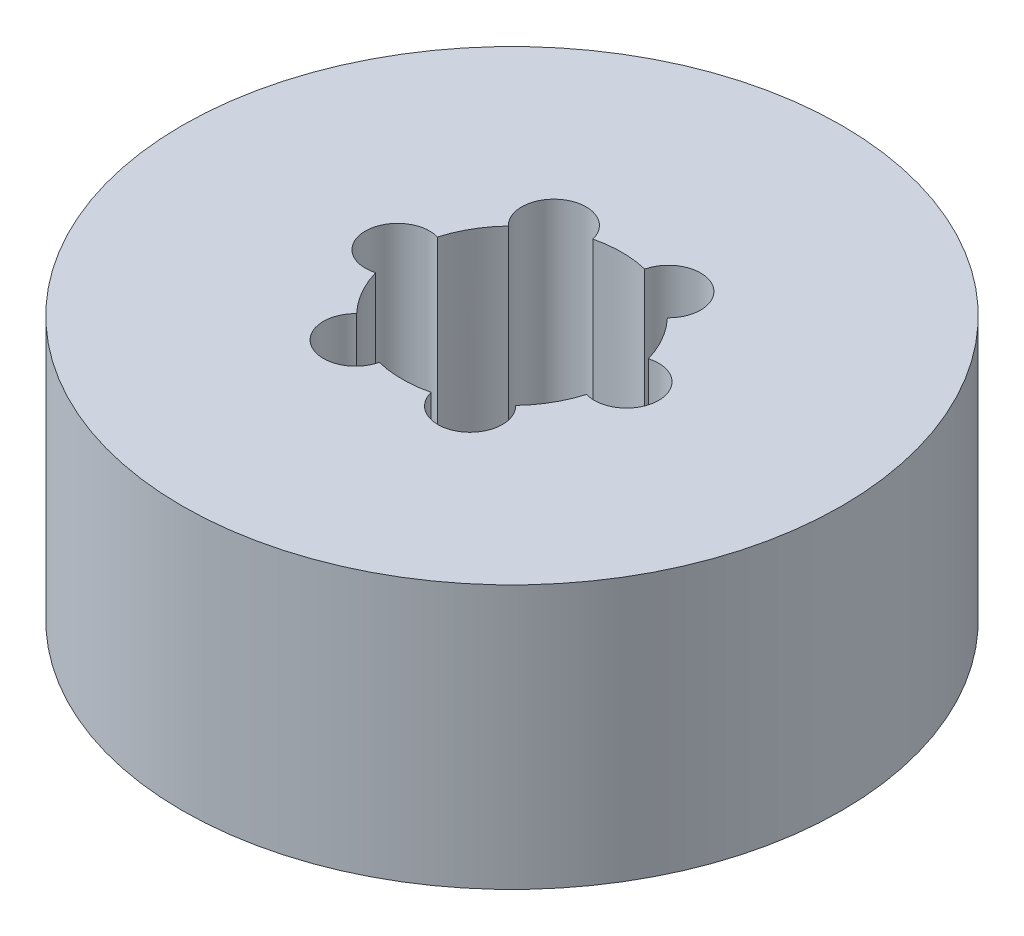
ISO-10303-21;
HEADER;
FILE_DESCRIPTION(('STEP AP214'),'2;1');
FILE_NAME('part.step','',(''),(''),'','','');
FILE_SCHEMA(('AUTOMOTIVE_DESIGN { 1 0 10303 214 1 1 1 1 }'));
ENDSEC;
DATA;
#1=APPLICATION_CONTEXT('core data for automotive mechanical design processes');
#2=APPLICATION_PROTOCOL_DEFINITION('international standard','automotive_design',2000,#1);
#3=PRODUCT_CONTEXT('',#1,'mechanical');
#4=PRODUCT('Part','Part','',(#3));
#5=PRODUCT_RELATED_PRODUCT_CATEGORY('part','',(#4));
#6=PRODUCT_DEFINITION_FORMATION('','',#4);
#7=PRODUCT_DEFINITION_CONTEXT('part definition',#1,'design');
#8=PRODUCT_DEFINITION('design','',#6,#7);
#9=PRODUCT_DEFINITION_SHAPE('','',#8);
#10=(LENGTH_UNIT() NAMED_UNIT(*) SI_UNIT(.MILLI.,.METRE.));
#11=(NAMED_UNIT(*) PLANE_ANGLE_UNIT() SI_UNIT($,.RADIAN.));
#12=(NAMED_UNIT(*) SI_UNIT($,.STERADIAN.) SOLID_ANGLE_UNIT());
#13=UNCERTAINTY_MEASURE_WITH_UNIT(LENGTH_MEASURE(1.E-05),#10,'distance_accuracy_value','');
#14=(GEOMETRIC_REPRESENTATION_CONTEXT(3) GLOBAL_UNCERTAINTY_ASSIGNED_CONTEXT((#13)) GLOBAL_UNIT_ASSIGNED_CONTEXT((#10,
#11,#12)) REPRESENTATION_CONTEXT('',''));
#15=CARTESIAN_POINT('',(0.,0.,0.));
#16=DIRECTION('',(0.,0.,1.));
#17=DIRECTION('',(1.,0.,0.));
#18=AXIS2_PLACEMENT_3D('',#15,#16,#17);
#19=CARTESIAN_POINT('',(0.,24.,0.));
#20=DIRECTION('',(0.,-1.,0.));
#21=DIRECTION('',(0.,0.,-1.));
#22=AXIS2_PLACEMENT_3D('',#19,#20,#21);
#23=CYLINDRICAL_SURFACE('',#22,30.);
#24=CARTESIAN_POINT('',(0.,24.,0.));
#25=DIRECTION('',(0.,1.,0.));
#26=DIRECTION('',(0.,0.,1.));
#27=AXIS2_PLACEMENT_3D('',#24,#25,#26);
#28=CIRCLE('',#27,30.);
#29=CARTESIAN_POINT('',(0.,24.,30.));
#30=VERTEX_POINT('',#29);
#31=EDGE_CURVE('E171',#30,#30,#28,.T.);
#32=ORIENTED_EDGE('',*,*,#31,.F.);
#33=EDGE_LOOP('',(#32));
#34=FACE_BOUND('',#33,.T.);
#35=CARTESIAN_POINT('',(0.,0.,0.));
#36=DIRECTION('',(0.,1.,0.));
#37=DIRECTION('',(0.,0.,1.));
#38=AXIS2_PLACEMENT_3D('',#35,#36,#37);
#39=CIRCLE('',#38,30.);
#40=CARTESIAN_POINT('',(0.,0.,30.));
#41=VERTEX_POINT('',#40);
#42=EDGE_CURVE('E157',#41,#41,#39,.T.);
#43=ORIENTED_EDGE('',*,*,#42,.T.);
#44=EDGE_LOOP('',(#43));
#45=FACE_BOUND('',#44,.T.);
#46=ADVANCED_FACE('F39',(#34,#45),#23,.T.);
#47=CARTESIAN_POINT('',(0.,24.,0.));
#48=DIRECTION('',(0.,1.,0.));
#49=DIRECTION('',(0.,0.,1.));
#50=AXIS2_PLACEMENT_3D('',#47,#48,#49);
#51=PLANE('',#50);
#52=CARTESIAN_POINT('',(-5.2085546806127,24.,-9.02148134082164));
#53=DIRECTION('',(0.,1.,0.));
#54=DIRECTION('',(-0.866025403784433,0.,0.50000000000001));
#55=AXIS2_PLACEMENT_3D('',#52,#53,#54);
#56=CIRCLE('',#55,2.931553515159);
#57=CARTESIAN_POINT('',(-2.36078586791407,24.,-9.71733966092866));
#58=VERTEX_POINT('',#57);
#59=CARTESIAN_POINT('',(-7.23507006960941,24.,-6.90317036497304));
#60=VERTEX_POINT('',#59);
#61=EDGE_CURVE('E214',#58,#60,#56,.T.);
#62=ORIENTED_EDGE('',*,*,#61,.F.);
#63=CARTESIAN_POINT('',(0.,24.,0.));
#64=DIRECTION('',(0.,1.,0.));
#65=DIRECTION('',(0.,0.,1.));
#66=AXIS2_PLACEMENT_3D('',#63,#64,#65);
#67=CIRCLE('',#66,10.);
#68=CARTESIAN_POINT('',(2.36078586791387,24.,-9.71733966092871));
#69=VERTEX_POINT('',#68);
#70=EDGE_CURVE('E272',#69,#58,#67,.T.);
#71=ORIENTED_EDGE('',*,*,#70,.F.);
#72=CARTESIAN_POINT('',(5.20855468061251,24.,-9.02148134082175));
#73=DIRECTION('',(0.,1.,0.));
#74=DIRECTION('',(-0.866025403784443,0.,-0.499999999999992));
#75=AXIS2_PLACEMENT_3D('',#72,#73,#74);
#76=CIRCLE('',#75,2.931553515159);
#77=CARTESIAN_POINT('',(7.23507006960926,24.,-6.9031703649732));
#78=VERTEX_POINT('',#77);
#79=EDGE_CURVE('E285',#78,#69,#76,.T.);
#80=ORIENTED_EDGE('',*,*,#79,.F.);
#81=CARTESIAN_POINT('',(9.59585593752329,24.,-2.81416929595556));
#82=VERTEX_POINT('',#81);
#83=EDGE_CURVE('E165',#82,#78,#67,.T.);
#84=ORIENTED_EDGE('',*,*,#83,.F.);
#85=CARTESIAN_POINT('',(10.4171093612252,24.,0.));
#86=DIRECTION('',(0.,1.,0.));
#87=DIRECTION('',(0.,0.,-1.));
#88=AXIS2_PLACEMENT_3D('',#85,#86,#87);
#89=CIRCLE('',#88,2.931553515159);
#90=CARTESIAN_POINT('',(9.59585593752329,24.,2.81416929595556));
#91=VERTEX_POINT('',#90);
#92=EDGE_CURVE('E281',#91,#82,#89,.T.);
#93=ORIENTED_EDGE('',*,*,#92,.F.);
#94=CARTESIAN_POINT('',(7.23507006960936,24.,6.9031703649731));
#95=VERTEX_POINT('',#94);
#96=EDGE_CURVE('E160',#95,#91,#67,.T.);
#97=ORIENTED_EDGE('',*,*,#96,.F.);
#98=CARTESIAN_POINT('',(5.20855468061264,24.,9.02148134082168));
#99=DIRECTION('',(0.,1.,0.));
#100=DIRECTION('',(0.866025403784436,0.,-0.500000000000004));
#101=AXIS2_PLACEMENT_3D('',#98,#99,#100);
#102=CIRCLE('',#101,2.931553515159);
#103=CARTESIAN_POINT('',(2.36078586791401,24.,9.71733966092868));
#104=VERTEX_POINT('',#103);
#105=EDGE_CURVE('E154',#104,#95,#102,.T.);
#106=ORIENTED_EDGE('',*,*,#105,.F.);
#107=CARTESIAN_POINT('',(-2.36078586791394,24.,9.7173396609287));
#108=VERTEX_POINT('',#107);
#109=EDGE_CURVE('E150',#108,#104,#67,.T.);
#110=ORIENTED_EDGE('',*,*,#109,.F.);
#111=CARTESIAN_POINT('',(-5.20855468061258,24.,9.02148134082172));
#112=DIRECTION('',(0.,1.,0.));
#113=DIRECTION('',(0.86602540378444,0.,0.499999999999998));
#114=AXIS2_PLACEMENT_3D('',#111,#112,#113);
#115=CIRCLE('',#114,2.931553515159);
#116=CARTESIAN_POINT('',(-7.23507006960931,24.,6.90317036497315));
#117=VERTEX_POINT('',#116);
#118=EDGE_CURVE('E127',#117,#108,#115,.T.);
#119=ORIENTED_EDGE('',*,*,#118,.F.);
#120=CARTESIAN_POINT('',(-9.59585593752329,24.,2.81416929595556));
#121=VERTEX_POINT('',#120);
#122=EDGE_CURVE('E156',#121,#117,#67,.T.);
#123=ORIENTED_EDGE('',*,*,#122,.F.);
#124=CARTESIAN_POINT('',(-10.4171093612252,24.,0.));
#125=DIRECTION('',(0.,1.,0.));
#126=DIRECTION('',(0.,0.,1.));
#127=AXIS2_PLACEMENT_3D('',#124,#125,#126);
#128=CIRCLE('',#127,2.931553515159);
#129=CARTESIAN_POINT('',(-9.59585593752329,24.,-2.81416929595556));
#130=VERTEX_POINT('',#129);
#131=EDGE_CURVE('E164',#130,#121,#128,.T.);
#132=ORIENTED_EDGE('',*,*,#131,.F.);
#133=EDGE_CURVE('E159',#60,#130,#67,.T.);
#134=ORIENTED_EDGE('',*,*,#133,.F.);
#135=EDGE_LOOP('',(#62,#71,#80,#84,#93,#97,#106,#110,#119,#123,#132,#134));
#136=FACE_BOUND('',#135,.T.);
#137=ORIENTED_EDGE('',*,*,#31,.T.);
#138=EDGE_LOOP('',(#137));
#139=FACE_BOUND('',#138,.T.);
#140=ADVANCED_FACE('F155',(#136,#139),#51,.T.);
#141=CARTESIAN_POINT('',(0.,0.,0.));
#142=DIRECTION('',(0.,1.,0.));
#143=DIRECTION('',(0.,0.,1.));
#144=AXIS2_PLACEMENT_3D('',#141,#142,#143);
#145=PLANE('',#144);
#146=CARTESIAN_POINT('',(0.,0.,0.));
#147=DIRECTION('',(0.,1.,0.));
#148=DIRECTION('',(0.,0.,1.));
#149=AXIS2_PLACEMENT_3D('',#146,#147,#148);
#150=CIRCLE('',#149,10.);
#151=CARTESIAN_POINT('',(0.,0.,10.));
#152=VERTEX_POINT('',#151);
#153=EDGE_CURVE('E170',#152,#152,#150,.T.);
#154=ORIENTED_EDGE('',*,*,#153,.T.);
#155=EDGE_LOOP('',(#154));
#156=FACE_BOUND('',#155,.T.);
#157=ORIENTED_EDGE('',*,*,#42,.F.);
#158=EDGE_LOOP('',(#157));
#159=FACE_BOUND('',#158,.T.);
#160=ADVANCED_FACE('F232',(#156,#159),#145,.F.);
#161=CARTESIAN_POINT('',(0.,24.,0.));
#162=DIRECTION('',(0.,-1.,0.));
#163=DIRECTION('',(0.,0.,-1.));
#164=AXIS2_PLACEMENT_3D('',#161,#162,#163);
#165=CYLINDRICAL_SURFACE('',#164,10.);
#166=DIRECTION('',(0.,1.,0.));
#167=VECTOR('',#166,1.);
#168=CARTESIAN_POINT('',(-2.36078586791407,13.5625818700478,-9.71733966092866));
#169=LINE('',#168,#167);
#170=CARTESIAN_POINT('',(-2.36078586791407,3.1251637400955,-9.71733966092866));
#171=VERTEX_POINT('',#170);
#172=EDGE_CURVE('E11',#171,#58,#169,.T.);
#173=ORIENTED_EDGE('',*,*,#172,.F.);
#174=CARTESIAN_POINT('',(0.,3.1251637400955,0.));
#175=DIRECTION('',(0.,1.,0.));
#176=DIRECTION('',(0.,0.,1.));
#177=AXIS2_PLACEMENT_3D('',#174,#175,#176);
#178=CIRCLE('',#177,10.);
#179=CARTESIAN_POINT('',(-7.23507006960941,3.1251637400955,-6.90317036497304));
#180=VERTEX_POINT('',#179);
#181=EDGE_CURVE('E209',#171,#180,#178,.T.);
#182=ORIENTED_EDGE('',*,*,#181,.T.);
#183=DIRECTION('',(0.,1.,0.));
#184=VECTOR('',#183,1.);
#185=CARTESIAN_POINT('',(-7.23507006960941,13.5625818700478,-6.90317036497305));
#186=LINE('',#185,#184);
#187=EDGE_CURVE('E46',#60,#180,#186,.F.);
#188=ORIENTED_EDGE('',*,*,#187,.F.);
#189=ORIENTED_EDGE('',*,*,#133,.T.);
#190=DIRECTION('',(0.,1.,0.));
#191=VECTOR('',#190,1.);
#192=CARTESIAN_POINT('',(-9.59585593752329,13.5625818700478,-2.81416929595556));
#193=LINE('',#192,#191);
#194=CARTESIAN_POINT('',(-9.59585593752329,3.1251637400955,-2.81416929595556));
#195=VERTEX_POINT('',#194);
#196=EDGE_CURVE('E185',#195,#130,#193,.T.);
#197=ORIENTED_EDGE('',*,*,#196,.F.);
#198=CARTESIAN_POINT('',(0.,3.1251637400955,0.));
#199=DIRECTION('',(0.,1.,0.));
#200=DIRECTION('',(0.,0.,1.));
#201=AXIS2_PLACEMENT_3D('',#198,#199,#200);
#202=CIRCLE('',#201,10.);
#203=CARTESIAN_POINT('',(-9.59585593752329,3.1251637400955,2.81416929595556));
#204=VERTEX_POINT('',#203);
#205=EDGE_CURVE('E173',#195,#204,#202,.T.);
#206=ORIENTED_EDGE('',*,*,#205,.T.);
#207=DIRECTION('',(0.,1.,0.));
#208=VECTOR('',#207,1.);
#209=CARTESIAN_POINT('',(-9.59585593752329,13.5625818700478,2.81416929595556));
#210=LINE('',#209,#208);
#211=EDGE_CURVE('E178',#121,#204,#210,.F.);
#212=ORIENTED_EDGE('',*,*,#211,.F.);
#213=ORIENTED_EDGE('',*,*,#122,.T.);
#214=DIRECTION('',(0.,1.,0.));
#215=VECTOR('',#214,1.);
#216=CARTESIAN_POINT('',(-7.23507006960931,13.5625818700478,6.90317036497315));
#217=LINE('',#216,#215);
#218=CARTESIAN_POINT('',(-7.23507006960931,3.1251637400955,6.90317036497315));
#219=VERTEX_POINT('',#218);
#220=EDGE_CURVE('E132',#219,#117,#217,.T.);
#221=ORIENTED_EDGE('',*,*,#220,.F.);
#222=CARTESIAN_POINT('',(0.,3.1251637400955,0.));
#223=DIRECTION('',(0.,1.,0.));
#224=DIRECTION('',(0.,0.,1.));
#225=AXIS2_PLACEMENT_3D('',#222,#223,#224);
#226=CIRCLE('',#225,10.);
#227=CARTESIAN_POINT('',(-2.36078586791394,3.1251637400955,9.7173396609287));
#228=VERTEX_POINT('',#227);
#229=EDGE_CURVE('E146',#219,#228,#226,.T.);
#230=ORIENTED_EDGE('',*,*,#229,.T.);
#231=DIRECTION('',(0.,1.,0.));
#232=VECTOR('',#231,1.);
#233=CARTESIAN_POINT('',(-2.36078586791394,13.5625818700478,9.7173396609287));
#234=LINE('',#233,#232);
#235=EDGE_CURVE('E128',#108,#228,#234,.F.);
#236=ORIENTED_EDGE('',*,*,#235,.F.);
#237=ORIENTED_EDGE('',*,*,#109,.T.);
#238=DIRECTION('',(0.,1.,0.));
#239=VECTOR('',#238,1.);
#240=CARTESIAN_POINT('',(2.36078586791401,13.5625818700478,9.71733966092868));
#241=LINE('',#240,#239);
#242=CARTESIAN_POINT('',(2.36078586791401,3.1251637400955,9.71733966092868));
#243=VERTEX_POINT('',#242);
#244=EDGE_CURVE('E192',#243,#104,#241,.T.);
#245=ORIENTED_EDGE('',*,*,#244,.F.);
#246=CARTESIAN_POINT('',(0.,3.1251637400955,0.));
#247=DIRECTION('',(0.,1.,0.));
#248=DIRECTION('',(0.,0.,1.));
#249=AXIS2_PLACEMENT_3D('',#246,#247,#248);
#250=CIRCLE('',#249,10.);
#251=CARTESIAN_POINT('',(7.23507006960936,3.1251637400955,6.9031703649731));
#252=VERTEX_POINT('',#251);
#253=EDGE_CURVE('E190',#243,#252,#250,.T.);
#254=ORIENTED_EDGE('',*,*,#253,.T.);
#255=DIRECTION('',(0.,1.,0.));
#256=VECTOR('',#255,1.);
#257=CARTESIAN_POINT('',(7.23507006960936,13.5625818700478,6.9031703649731));
#258=LINE('',#257,#256);
#259=EDGE_CURVE('E189',#95,#252,#258,.F.);
#260=ORIENTED_EDGE('',*,*,#259,.F.);
#261=ORIENTED_EDGE('',*,*,#96,.T.);
#262=DIRECTION('',(0.,1.,0.));
#263=VECTOR('',#262,1.);
#264=CARTESIAN_POINT('',(9.59585593752329,13.5625818700478,2.81416929595556));
#265=LINE('',#264,#263);
#266=CARTESIAN_POINT('',(9.59585593752329,3.1251637400955,2.81416929595556));
#267=VERTEX_POINT('',#266);
#268=EDGE_CURVE('E203',#267,#91,#265,.T.);
#269=ORIENTED_EDGE('',*,*,#268,.F.);
#270=CARTESIAN_POINT('',(0.,3.1251637400955,0.));
#271=DIRECTION('',(0.,1.,0.));
#272=DIRECTION('',(0.,0.,1.));
#273=AXIS2_PLACEMENT_3D('',#270,#271,#272);
#274=CIRCLE('',#273,10.);
#275=CARTESIAN_POINT('',(9.59585593752329,3.1251637400955,-2.81416929595556));
#276=VERTEX_POINT('',#275);
#277=EDGE_CURVE('E194',#267,#276,#274,.T.);
#278=ORIENTED_EDGE('',*,*,#277,.T.);
#279=DIRECTION('',(0.,1.,0.));
#280=VECTOR('',#279,1.);
#281=CARTESIAN_POINT('',(9.59585593752329,13.5625818700478,-2.81416929595556));
#282=LINE('',#281,#280);
#283=EDGE_CURVE('E196',#82,#276,#282,.F.);
#284=ORIENTED_EDGE('',*,*,#283,.F.);
#285=ORIENTED_EDGE('',*,*,#83,.T.);
#286=DIRECTION('',(0.,1.,0.));
#287=VECTOR('',#286,1.);
#288=CARTESIAN_POINT('',(7.23507006960926,13.5625818700478,-6.9031703649732));
#289=LINE('',#288,#287);
#290=CARTESIAN_POINT('',(7.23507006960926,3.1251637400955,-6.9031703649732));
#291=VERTEX_POINT('',#290);
#292=EDGE_CURVE('E208',#291,#78,#289,.T.);
#293=ORIENTED_EDGE('',*,*,#292,.F.);
#294=CARTESIAN_POINT('',(0.,3.1251637400955,0.));
#295=DIRECTION('',(0.,1.,0.));
#296=DIRECTION('',(0.,0.,1.));
#297=AXIS2_PLACEMENT_3D('',#294,#295,#296);
#298=CIRCLE('',#297,10.);
#299=CARTESIAN_POINT('',(2.36078586791387,3.1251637400955,-9.71733966092871));
#300=VERTEX_POINT('',#299);
#301=EDGE_CURVE('E201',#291,#300,#298,.T.);
#302=ORIENTED_EDGE('',*,*,#301,.T.);
#303=DIRECTION('',(0.,1.,0.));
#304=VECTOR('',#303,1.);
#305=CARTESIAN_POINT('',(2.36078586791387,13.5625818700478,-9.71733966092871));
#306=LINE('',#305,#304);
#307=EDGE_CURVE('E206',#69,#300,#306,.F.);
#308=ORIENTED_EDGE('',*,*,#307,.F.);
#309=ORIENTED_EDGE('',*,*,#70,.T.);
#310=EDGE_LOOP('',(#173,#182,#188,#189,#197,#206,#212,#213,#221,#230,#236,#237,#245,#254,#260,
#261,#269,#278,#284,#285,#293,#302,#308,#309));
#311=FACE_BOUND('',#310,.T.);
#312=ORIENTED_EDGE('',*,*,#153,.F.);
#313=EDGE_LOOP('',(#312));
#314=FACE_BOUND('',#313,.T.);
#315=ADVANCED_FACE('F145',(#311,#314),#165,.F.);
#316=CARTESIAN_POINT('',(-10.4171093612252,3.1251637400955,0.));
#317=DIRECTION('',(0.,1.,0.));
#318=DIRECTION('',(0.,0.,1.));
#319=AXIS2_PLACEMENT_3D('',#316,#317,#318);
#320=CYLINDRICAL_SURFACE('',#319,2.931553515159);
#321=ORIENTED_EDGE('',*,*,#196,.T.);
#322=ORIENTED_EDGE('',*,*,#131,.T.);
#323=ORIENTED_EDGE('',*,*,#211,.T.);
#324=CARTESIAN_POINT('',(-10.4171093612252,3.1251637400955,0.));
#325=DIRECTION('',(0.,1.,0.));
#326=DIRECTION('',(0.,0.,1.));
#327=AXIS2_PLACEMENT_3D('',#324,#325,#326);
#328=CIRCLE('',#327,2.931553515159);
#329=EDGE_CURVE('E168',#195,#204,#328,.T.);
#330=ORIENTED_EDGE('',*,*,#329,.F.);
#331=EDGE_LOOP('',(#321,#322,#323,#330));
#332=FACE_BOUND('',#331,.T.);
#333=ADVANCED_FACE('F243',(#332),#320,.F.);
#334=CARTESIAN_POINT('',(-10.4171093612252,3.1251637400955,0.));
#335=DIRECTION('',(0.,1.,0.));
#336=DIRECTION('',(0.,0.,1.));
#337=AXIS2_PLACEMENT_3D('',#334,#335,#336);
#338=PLANE('',#337);
#339=ORIENTED_EDGE('',*,*,#329,.T.);
#340=ORIENTED_EDGE('',*,*,#205,.F.);
#341=EDGE_LOOP('',(#339,#340));
#342=FACE_BOUND('',#341,.T.);
#343=ADVANCED_FACE('F247',(#342),#338,.T.);
#344=CARTESIAN_POINT('',(-5.20855468061258,3.1251637400955,9.02148134082172));
#345=DIRECTION('',(0.,1.,0.));
#346=DIRECTION('',(0.,0.,1.));
#347=AXIS2_PLACEMENT_3D('',#344,#345,#346);
#348=CYLINDRICAL_SURFACE('',#347,2.931553515159);
#349=ORIENTED_EDGE('',*,*,#220,.T.);
#350=ORIENTED_EDGE('',*,*,#118,.T.);
#351=ORIENTED_EDGE('',*,*,#235,.T.);
#352=CARTESIAN_POINT('',(-5.20855468061258,3.1251637400955,9.02148134082172));
#353=DIRECTION('',(0.,1.,0.));
#354=DIRECTION('',(0.86602540378444,0.,0.499999999999998));
#355=AXIS2_PLACEMENT_3D('',#352,#353,#354);
#356=CIRCLE('',#355,2.931553515159);
#357=EDGE_CURVE('E137',#219,#228,#356,.T.);
#358=ORIENTED_EDGE('',*,*,#357,.F.);
#359=EDGE_LOOP('',(#349,#350,#351,#358));
#360=FACE_BOUND('',#359,.T.);
#361=ADVANCED_FACE('F126',(#360),#348,.F.);
#362=CARTESIAN_POINT('',(-5.20855468061258,3.1251637400955,9.02148134082172));
#363=DIRECTION('',(0.,1.,0.));
#364=DIRECTION('',(0.86602540378444,0.,0.499999999999998));
#365=AXIS2_PLACEMENT_3D('',#362,#363,#364);
#366=PLANE('',#365);
#367=ORIENTED_EDGE('',*,*,#357,.T.);
#368=ORIENTED_EDGE('',*,*,#229,.F.);
#369=EDGE_LOOP('',(#367,#368));
#370=FACE_BOUND('',#369,.T.);
#371=ADVANCED_FACE('F254',(#370),#366,.T.);
#372=CARTESIAN_POINT('',(5.20855468061264,3.1251637400955,9.02148134082168));
#373=DIRECTION('',(0.,1.,0.));
#374=DIRECTION('',(0.,0.,1.));
#375=AXIS2_PLACEMENT_3D('',#372,#373,#374);
#376=CYLINDRICAL_SURFACE('',#375,2.931553515159);
#377=ORIENTED_EDGE('',*,*,#244,.T.);
#378=ORIENTED_EDGE('',*,*,#105,.T.);
#379=ORIENTED_EDGE('',*,*,#259,.T.);
#380=CARTESIAN_POINT('',(5.20855468061264,3.1251637400955,9.02148134082168));
#381=DIRECTION('',(0.,1.,0.));
#382=DIRECTION('',(0.866025403784436,0.,-0.500000000000004));
#383=AXIS2_PLACEMENT_3D('',#380,#381,#382);
#384=CIRCLE('',#383,2.931553515159);
#385=EDGE_CURVE('E138',#243,#252,#384,.T.);
#386=ORIENTED_EDGE('',*,*,#385,.F.);
#387=EDGE_LOOP('',(#377,#378,#379,#386));
#388=FACE_BOUND('',#387,.T.);
#389=ADVANCED_FACE('F260',(#388),#376,.F.);
#390=CARTESIAN_POINT('',(5.20855468061264,3.1251637400955,9.02148134082168));
#391=DIRECTION('',(0.,1.,0.));
#392=DIRECTION('',(0.866025403784436,0.,-0.500000000000004));
#393=AXIS2_PLACEMENT_3D('',#390,#391,#392);
#394=PLANE('',#393);
#395=ORIENTED_EDGE('',*,*,#385,.T.);
#396=ORIENTED_EDGE('',*,*,#253,.F.);
#397=EDGE_LOOP('',(#395,#396));
#398=FACE_BOUND('',#397,.T.);
#399=ADVANCED_FACE('F265',(#398),#394,.T.);
#400=CARTESIAN_POINT('',(10.4171093612252,3.1251637400955,0.));
#401=DIRECTION('',(0.,1.,0.));
#402=DIRECTION('',(0.,0.,1.));
#403=AXIS2_PLACEMENT_3D('',#400,#401,#402);
#404=CYLINDRICAL_SURFACE('',#403,2.931553515159);
#405=ORIENTED_EDGE('',*,*,#268,.T.);
#406=ORIENTED_EDGE('',*,*,#92,.T.);
#407=ORIENTED_EDGE('',*,*,#283,.T.);
#408=CARTESIAN_POINT('',(10.4171093612252,3.1251637400955,0.));
#409=DIRECTION('',(0.,1.,0.));
#410=DIRECTION('',(0.,0.,-1.));
#411=AXIS2_PLACEMENT_3D('',#408,#409,#410);
#412=CIRCLE('',#411,2.931553515159);
#413=EDGE_CURVE('E287',#267,#276,#412,.T.);
#414=ORIENTED_EDGE('',*,*,#413,.F.);
#415=EDGE_LOOP('',(#405,#406,#407,#414));
#416=FACE_BOUND('',#415,.T.);
#417=ADVANCED_FACE('F300',(#416),#404,.F.);
#418=CARTESIAN_POINT('',(10.4171093612252,3.1251637400955,0.));
#419=DIRECTION('',(0.,1.,0.));
#420=DIRECTION('',(0.,0.,-1.));
#421=AXIS2_PLACEMENT_3D('',#418,#419,#420);
#422=PLANE('',#421);
#423=ORIENTED_EDGE('',*,*,#413,.T.);
#424=ORIENTED_EDGE('',*,*,#277,.F.);
#425=EDGE_LOOP('',(#423,#424));
#426=FACE_BOUND('',#425,.T.);
#427=ADVANCED_FACE('F298',(#426),#422,.T.);
#428=CARTESIAN_POINT('',(5.20855468061251,3.1251637400955,-9.02148134082175));
#429=DIRECTION('',(0.,1.,0.));
#430=DIRECTION('',(0.,0.,1.));
#431=AXIS2_PLACEMENT_3D('',#428,#429,#430);
#432=CYLINDRICAL_SURFACE('',#431,2.931553515159);
#433=ORIENTED_EDGE('',*,*,#292,.T.);
#434=ORIENTED_EDGE('',*,*,#79,.T.);
#435=ORIENTED_EDGE('',*,*,#307,.T.);
#436=CARTESIAN_POINT('',(5.20855468061251,3.1251637400955,-9.02148134082175));
#437=DIRECTION('',(0.,1.,0.));
#438=DIRECTION('',(-0.866025403784443,0.,-0.499999999999992));
#439=AXIS2_PLACEMENT_3D('',#436,#437,#438);
#440=CIRCLE('',#439,2.931553515159);
#441=EDGE_CURVE('E56',#291,#300,#440,.T.);
#442=ORIENTED_EDGE('',*,*,#441,.F.);
#443=EDGE_LOOP('',(#433,#434,#435,#442));
#444=FACE_BOUND('',#443,.T.);
#445=ADVANCED_FACE('F301',(#444),#432,.F.);
#446=CARTESIAN_POINT('',(5.20855468061251,3.1251637400955,-9.02148134082175));
#447=DIRECTION('',(0.,1.,0.));
#448=DIRECTION('',(-0.866025403784443,0.,-0.499999999999992));
#449=AXIS2_PLACEMENT_3D('',#446,#447,#448);
#450=PLANE('',#449);
#451=ORIENTED_EDGE('',*,*,#441,.T.);
#452=ORIENTED_EDGE('',*,*,#301,.F.);
#453=EDGE_LOOP('',(#451,#452));
#454=FACE_BOUND('',#453,.T.);
#455=ADVANCED_FACE('F221',(#454),#450,.T.);
#456=CARTESIAN_POINT('',(-5.2085546806127,3.1251637400955,-9.02148134082164));
#457=DIRECTION('',(0.,1.,0.));
#458=DIRECTION('',(0.,0.,1.));
#459=AXIS2_PLACEMENT_3D('',#456,#457,#458);
#460=CYLINDRICAL_SURFACE('',#459,2.931553515159);
#461=ORIENTED_EDGE('',*,*,#172,.T.);
#462=ORIENTED_EDGE('',*,*,#61,.T.);
#463=ORIENTED_EDGE('',*,*,#187,.T.);
#464=CARTESIAN_POINT('',(-5.2085546806127,3.1251637400955,-9.02148134082164));
#465=DIRECTION('',(0.,1.,0.));
#466=DIRECTION('',(-0.866025403784433,0.,0.50000000000001));
#467=AXIS2_PLACEMENT_3D('',#464,#465,#466);
#468=CIRCLE('',#467,2.931553515159);
#469=EDGE_CURVE('E55',#171,#180,#468,.T.);
#470=ORIENTED_EDGE('',*,*,#469,.F.);
#471=EDGE_LOOP('',(#461,#462,#463,#470));
#472=FACE_BOUND('',#471,.T.);
#473=ADVANCED_FACE('F212',(#472),#460,.F.);
#474=CARTESIAN_POINT('',(-5.2085546806127,3.1251637400955,-9.02148134082164));
#475=DIRECTION('',(0.,1.,0.));
#476=DIRECTION('',(-0.866025403784433,0.,0.50000000000001));
#477=AXIS2_PLACEMENT_3D('',#474,#475,#476);
#478=PLANE('',#477);
#479=ORIENTED_EDGE('',*,*,#469,.T.);
#480=ORIENTED_EDGE('',*,*,#181,.F.);
#481=EDGE_LOOP('',(#479,#480));
#482=FACE_BOUND('',#481,.T.);
#483=ADVANCED_FACE('F217',(#482),#478,.T.);
#484=CLOSED_SHELL('',(#46,#140,#160,#315,#333,#343,#361,#371,#389,#399,#417,#427,#445,#455,#473,#483));
#485=MANIFOLD_SOLID_BREP('B2',#484);
#486=ADVANCED_BREP_SHAPE_REPRESENTATION('',(#18,#485),#14);
#487=SHAPE_DEFINITION_REPRESENTATION(#9,#486);
ENDSEC;
END-ISO-10303-21;
